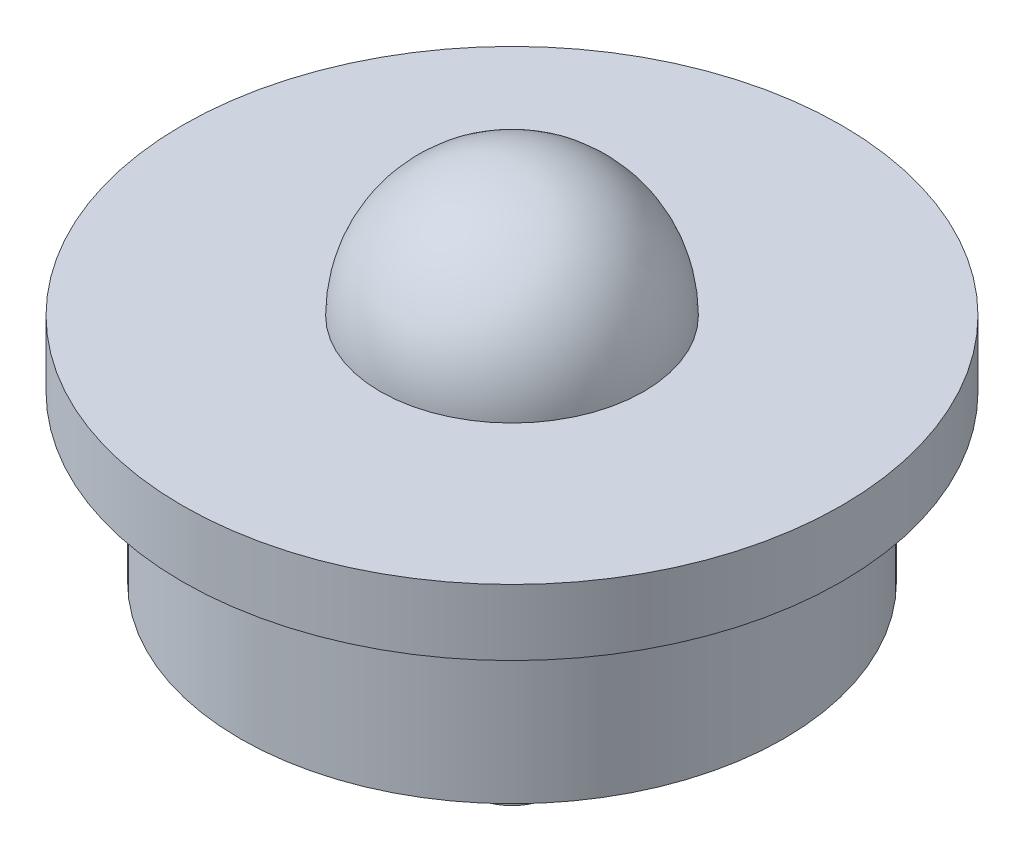
ISO-10303-21;
HEADER;
FILE_DESCRIPTION(('STEP AP214'),'2;1');
FILE_NAME('part.step','',(''),(''),'','','');
FILE_SCHEMA(('AUTOMOTIVE_DESIGN { 1 0 10303 214 1 1 1 1 }'));
ENDSEC;
DATA;
#1=APPLICATION_CONTEXT('core data for automotive mechanical design processes');
#2=APPLICATION_PROTOCOL_DEFINITION('international standard','automotive_design',2000,#1);
#3=PRODUCT_CONTEXT('',#1,'mechanical');
#4=PRODUCT('Part','Part','',(#3));
#5=PRODUCT_RELATED_PRODUCT_CATEGORY('part','',(#4));
#6=PRODUCT_DEFINITION_FORMATION('','',#4);
#7=PRODUCT_DEFINITION_CONTEXT('part definition',#1,'design');
#8=PRODUCT_DEFINITION('design','',#6,#7);
#9=PRODUCT_DEFINITION_SHAPE('','',#8);
#10=(LENGTH_UNIT() NAMED_UNIT(*) SI_UNIT(.MILLI.,.METRE.));
#11=(NAMED_UNIT(*) PLANE_ANGLE_UNIT() SI_UNIT($,.RADIAN.));
#12=(NAMED_UNIT(*) SI_UNIT($,.STERADIAN.) SOLID_ANGLE_UNIT());
#13=UNCERTAINTY_MEASURE_WITH_UNIT(LENGTH_MEASURE(1.E-05),#10,'distance_accuracy_value','');
#14=(GEOMETRIC_REPRESENTATION_CONTEXT(3) GLOBAL_UNCERTAINTY_ASSIGNED_CONTEXT((#13)) GLOBAL_UNIT_ASSIGNED_CONTEXT((#10,
#11,#12)) REPRESENTATION_CONTEXT('',''));
#15=CARTESIAN_POINT('',(0.,0.,0.));
#16=DIRECTION('',(0.,0.,1.));
#17=DIRECTION('',(1.,0.,0.));
#18=AXIS2_PLACEMENT_3D('',#15,#16,#17);
#19=CARTESIAN_POINT('',(0.,0.,0.));
#20=DIRECTION('',(0.,1.,0.));
#21=DIRECTION('',(0.,0.,1.));
#22=AXIS2_PLACEMENT_3D('',#19,#20,#21);
#23=PLANE('',#22);
#24=CARTESIAN_POINT('',(0.,0.,0.));
#25=DIRECTION('',(0.,1.,0.));
#26=DIRECTION('',(0.,0.,1.));
#27=AXIS2_PLACEMENT_3D('',#24,#25,#26);
#28=CIRCLE('',#27,26.19375);
#29=CARTESIAN_POINT('',(0.,0.,26.19375));
#30=VERTEX_POINT('',#29);
#31=EDGE_CURVE('E43',#30,#30,#28,.T.);
#32=ORIENTED_EDGE('',*,*,#31,.F.);
#33=EDGE_LOOP('',(#32));
#34=FACE_BOUND('',#33,.T.);
#35=CARTESIAN_POINT('',(0.,0.,0.));
#36=DIRECTION('',(0.,1.,0.));
#37=DIRECTION('',(0.,0.,1.));
#38=AXIS2_PLACEMENT_3D('',#35,#36,#37);
#39=CIRCLE('',#38,3.96875);
#40=CARTESIAN_POINT('',(0.,0.,3.96875));
#41=VERTEX_POINT('',#40);
#42=EDGE_CURVE('E10',#41,#41,#39,.F.);
#43=ORIENTED_EDGE('',*,*,#42,.F.);
#44=EDGE_LOOP('',(#43));
#45=FACE_BOUND('',#44,.T.);
#46=ADVANCED_FACE('F32',(#34,#45),#23,.F.);
#47=CARTESIAN_POINT('',(0.,22.225,0.));
#48=DIRECTION('',(0.,1.,0.));
#49=DIRECTION('',(0.,0.,1.));
#50=AXIS2_PLACEMENT_3D('',#47,#48,#49);
#51=PLANE('',#50);
#52=CARTESIAN_POINT('',(0.,22.225,0.));
#53=DIRECTION('',(0.,1.,0.));
#54=DIRECTION('',(0.,0.,1.));
#55=AXIS2_PLACEMENT_3D('',#52,#53,#54);
#56=CIRCLE('',#55,31.75);
#57=CARTESIAN_POINT('',(0.,22.225,31.75));
#58=VERTEX_POINT('',#57);
#59=EDGE_CURVE('E53',#58,#58,#56,.T.);
#60=ORIENTED_EDGE('',*,*,#59,.T.);
#61=EDGE_LOOP('',(#60));
#62=FACE_BOUND('',#61,.T.);
#63=CARTESIAN_POINT('',(0.,22.225,0.));
#64=DIRECTION('',(0.,1.,0.));
#65=DIRECTION('',(0.,0.,1.));
#66=AXIS2_PLACEMENT_3D('',#63,#64,#65);
#67=CIRCLE('',#66,12.7);
#68=CARTESIAN_POINT('',(0.,22.225,12.7));
#69=VERTEX_POINT('',#68);
#70=EDGE_CURVE('E51',#69,#69,#67,.F.);
#71=ORIENTED_EDGE('',*,*,#70,.T.);
#72=EDGE_LOOP('',(#71));
#73=FACE_BOUND('',#72,.T.);
#74=ADVANCED_FACE('F78',(#62,#73),#51,.T.);
#75=CARTESIAN_POINT('',(0.,22.225,0.));
#76=DIRECTION('',(0.,-1.,0.));
#77=DIRECTION('',(0.,0.,-1.));
#78=AXIS2_PLACEMENT_3D('',#75,#76,#77);
#79=CYLINDRICAL_SURFACE('',#78,26.19375);
#80=ORIENTED_EDGE('',*,*,#31,.T.);
#81=EDGE_LOOP('',(#80));
#82=FACE_BOUND('',#81,.T.);
#83=CARTESIAN_POINT('',(0.,15.875,0.));
#84=DIRECTION('',(0.,1.,0.));
#85=DIRECTION('',(0.,0.,1.));
#86=AXIS2_PLACEMENT_3D('',#83,#84,#85);
#87=CIRCLE('',#86,26.19375);
#88=CARTESIAN_POINT('',(0.,15.875,26.19375));
#89=VERTEX_POINT('',#88);
#90=EDGE_CURVE('E39',#89,#89,#87,.T.);
#91=ORIENTED_EDGE('',*,*,#90,.F.);
#92=EDGE_LOOP('',(#91));
#93=FACE_BOUND('',#92,.T.);
#94=ADVANCED_FACE('F34',(#82,#93),#79,.T.);
#95=CARTESIAN_POINT('',(0.,15.875,0.));
#96=DIRECTION('',(0.,1.,0.));
#97=DIRECTION('',(0.,0.,1.));
#98=AXIS2_PLACEMENT_3D('',#95,#96,#97);
#99=PLANE('',#98);
#100=CARTESIAN_POINT('',(0.,15.875,0.));
#101=DIRECTION('',(0.,1.,0.));
#102=DIRECTION('',(0.,0.,1.));
#103=AXIS2_PLACEMENT_3D('',#100,#101,#102);
#104=CIRCLE('',#103,31.75);
#105=CARTESIAN_POINT('',(0.,15.875,31.75));
#106=VERTEX_POINT('',#105);
#107=EDGE_CURVE('E48',#106,#106,#104,.T.);
#108=ORIENTED_EDGE('',*,*,#107,.F.);
#109=EDGE_LOOP('',(#108));
#110=FACE_BOUND('',#109,.T.);
#111=ORIENTED_EDGE('',*,*,#90,.T.);
#112=EDGE_LOOP('',(#111));
#113=FACE_BOUND('',#112,.T.);
#114=ADVANCED_FACE('F69',(#110,#113),#99,.F.);
#115=CARTESIAN_POINT('',(0.,15.875,0.));
#116=DIRECTION('',(0.,1.,0.));
#117=DIRECTION('',(0.,0.,1.));
#118=AXIS2_PLACEMENT_3D('',#115,#116,#117);
#119=CYLINDRICAL_SURFACE('',#118,31.75);
#120=ORIENTED_EDGE('',*,*,#107,.T.);
#121=EDGE_LOOP('',(#120));
#122=FACE_BOUND('',#121,.T.);
#123=ORIENTED_EDGE('',*,*,#59,.F.);
#124=EDGE_LOOP('',(#123));
#125=FACE_BOUND('',#124,.T.);
#126=ADVANCED_FACE('F66',(#122,#125),#119,.T.);
#127=CARTESIAN_POINT('',(0.,22.225,0.));
#128=DIRECTION('',(0.,0.,-1.));
#129=DIRECTION('',(1.,0.,0.));
#130=AXIS2_PLACEMENT_3D('',#127,#128,#129);
#131=SPHERICAL_SURFACE('',#130,12.7);
#132=CARTESIAN_POINT('',(0.,22.225,0.));
#133=DIRECTION('',(0.,1.,0.));
#134=DIRECTION('',(0.,0.,1.));
#135=AXIS2_PLACEMENT_3D('',#132,#133,#134);
#136=SPHERICAL_SURFACE('',#135,12.7);
#137=ORIENTED_EDGE('',*,*,#70,.F.);
#138=EDGE_LOOP('',(#137));
#139=FACE_BOUND('',#138,.T.);
#140=ADVANCED_FACE('F76',(#139),#136,.T.);
#141=CARTESIAN_POINT('',(0.,-15.875,0.));
#142=DIRECTION('',(0.,1.,0.));
#143=DIRECTION('',(0.,0.,1.));
#144=AXIS2_PLACEMENT_3D('',#141,#142,#143);
#145=CYLINDRICAL_SURFACE('',#144,3.96875);
#146=CARTESIAN_POINT('',(0.,-15.875,0.));
#147=DIRECTION('',(0.,-1.,0.));
#148=DIRECTION('',(0.,0.,-1.));
#149=AXIS2_PLACEMENT_3D('',#146,#147,#148);
#150=CIRCLE('',#149,3.96875);
#151=CARTESIAN_POINT('',(0.,-15.875,-3.96875));
#152=VERTEX_POINT('',#151);
#153=EDGE_CURVE('E54',#152,#152,#150,.T.);
#154=ORIENTED_EDGE('',*,*,#153,.F.);
#155=EDGE_LOOP('',(#154));
#156=FACE_BOUND('',#155,.T.);
#157=ORIENTED_EDGE('',*,*,#42,.T.);
#158=EDGE_LOOP('',(#157));
#159=FACE_BOUND('',#158,.T.);
#160=ADVANCED_FACE('F117',(#156,#159),#145,.T.);
#161=CARTESIAN_POINT('',(0.,-15.875,0.));
#162=DIRECTION('',(0.,-1.,0.));
#163=DIRECTION('',(0.,0.,-1.));
#164=AXIS2_PLACEMENT_3D('',#161,#162,#163);
#165=PLANE('',#164);
#166=ORIENTED_EDGE('',*,*,#153,.T.);
#167=EDGE_LOOP('',(#166));
#168=FACE_BOUND('',#167,.T.);
#169=ADVANCED_FACE('F124',(#168),#165,.T.);
#170=CLOSED_SHELL('',(#46,#74,#94,#114,#126,#140,#160,#169));
#171=MANIFOLD_SOLID_BREP('B2',#170);
#172=ADVANCED_BREP_SHAPE_REPRESENTATION('',(#18,#171),#14);
#173=SHAPE_DEFINITION_REPRESENTATION(#9,#172);
ENDSEC;
END-ISO-10303-21;
